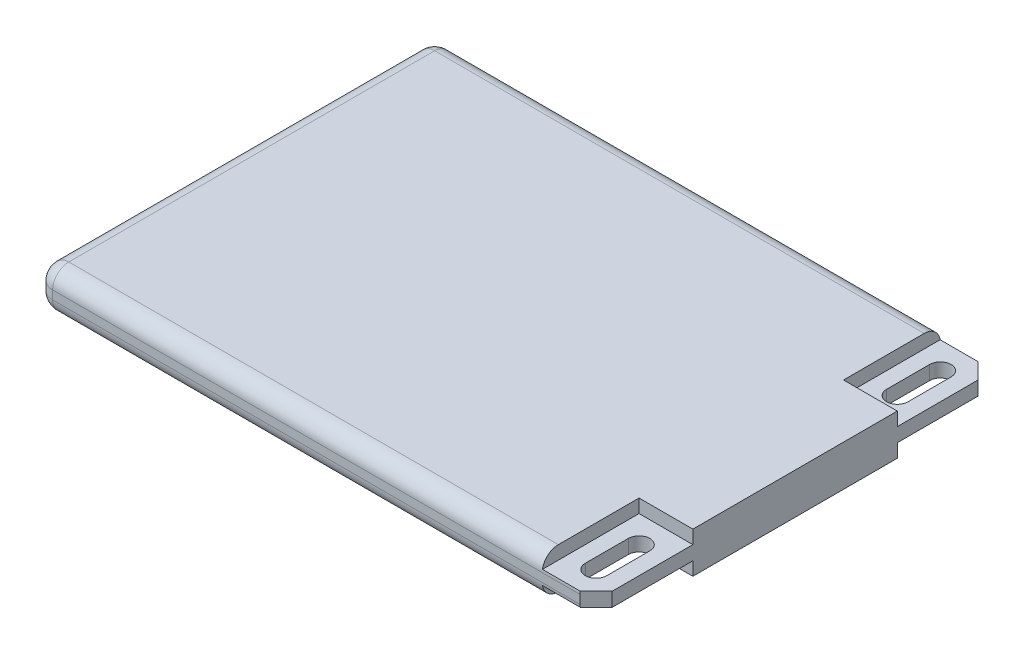
ISO-10303-21;
HEADER;
FILE_DESCRIPTION(('STEP AP214'),'2;1');
FILE_NAME('part.step','',(''),(''),'','','');
FILE_SCHEMA(('AUTOMOTIVE_DESIGN { 1 0 10303 214 1 1 1 1 }'));
ENDSEC;
DATA;
#1=APPLICATION_CONTEXT('core data for automotive mechanical design processes');
#2=APPLICATION_PROTOCOL_DEFINITION('international standard','automotive_design',2000,#1);
#3=PRODUCT_CONTEXT('',#1,'mechanical');
#4=PRODUCT('Part','Part','',(#3));
#5=PRODUCT_RELATED_PRODUCT_CATEGORY('part','',(#4));
#6=PRODUCT_DEFINITION_FORMATION('','',#4);
#7=PRODUCT_DEFINITION_CONTEXT('part definition',#1,'design');
#8=PRODUCT_DEFINITION('design','',#6,#7);
#9=PRODUCT_DEFINITION_SHAPE('','',#8);
#10=(LENGTH_UNIT() NAMED_UNIT(*) SI_UNIT(.MILLI.,.METRE.));
#11=(NAMED_UNIT(*) PLANE_ANGLE_UNIT() SI_UNIT($,.RADIAN.));
#12=(NAMED_UNIT(*) SI_UNIT($,.STERADIAN.) SOLID_ANGLE_UNIT());
#13=UNCERTAINTY_MEASURE_WITH_UNIT(LENGTH_MEASURE(1.E-05),#10,'distance_accuracy_value','');
#14=(GEOMETRIC_REPRESENTATION_CONTEXT(3) GLOBAL_UNCERTAINTY_ASSIGNED_CONTEXT((#13)) GLOBAL_UNIT_ASSIGNED_CONTEXT((#10,
#11,#12)) REPRESENTATION_CONTEXT('',''));
#15=CARTESIAN_POINT('',(0.,0.,0.));
#16=DIRECTION('',(0.,0.,1.));
#17=DIRECTION('',(1.,0.,0.));
#18=AXIS2_PLACEMENT_3D('',#15,#16,#17);
#19=CARTESIAN_POINT('',(26.,1.9,18.5));
#20=DIRECTION('',(-1.,0.,0.));
#21=DIRECTION('',(0.,0.,1.));
#22=AXIS2_PLACEMENT_3D('',#19,#20,#21);
#23=PLANE('',#22);
#24=DIRECTION('',(0.,0.,-1.));
#25=VECTOR('',#24,1.);
#26=CARTESIAN_POINT('',(26.,0.65,18.5));
#27=LINE('',#26,#25);
#28=CARTESIAN_POINT('',(26.,0.65,17.));
#29=VERTEX_POINT('',#28);
#30=CARTESIAN_POINT('',(26.,0.65,9.5));
#31=VERTEX_POINT('',#30);
#32=EDGE_CURVE('E336',#29,#31,#27,.T.);
#33=ORIENTED_EDGE('',*,*,#32,.F.);
#34=DIRECTION('',(0.,-1.,0.));
#35=VECTOR('',#34,1.);
#36=CARTESIAN_POINT('',(26.,1.9,17.));
#37=LINE('',#36,#35);
#38=CARTESIAN_POINT('',(26.,-0.65,17.));
#39=VERTEX_POINT('',#38);
#40=EDGE_CURVE('E395',#29,#39,#37,.T.);
#41=ORIENTED_EDGE('',*,*,#40,.T.);
#42=DIRECTION('',(0.,0.,-1.));
#43=VECTOR('',#42,1.);
#44=CARTESIAN_POINT('',(26.,-0.65,18.5));
#45=LINE('',#44,#43);
#46=CARTESIAN_POINT('',(26.,-0.65,9.5));
#47=VERTEX_POINT('',#46);
#48=EDGE_CURVE('E300',#39,#47,#45,.T.);
#49=ORIENTED_EDGE('',*,*,#48,.T.);
#50=DIRECTION('',(0.,-1.,0.));
#51=VECTOR('',#50,1.);
#52=CARTESIAN_POINT('',(26.,-0.65,9.5));
#53=LINE('',#52,#51);
#54=CARTESIAN_POINT('',(26.,-1.9,9.5));
#55=VERTEX_POINT('',#54);
#56=EDGE_CURVE('E313',#47,#55,#53,.T.);
#57=ORIENTED_EDGE('',*,*,#56,.T.);
#58=DIRECTION('',(0.,0.,-1.));
#59=VECTOR('',#58,1.);
#60=CARTESIAN_POINT('',(26.,-1.9,18.5));
#61=LINE('',#60,#59);
#62=CARTESIAN_POINT('',(26.,-1.9,-9.49999999999999));
#63=VERTEX_POINT('',#62);
#64=EDGE_CURVE('E368',#55,#63,#61,.T.);
#65=ORIENTED_EDGE('',*,*,#64,.T.);
#66=DIRECTION('',(0.,-1.,0.));
#67=VECTOR('',#66,1.);
#68=CARTESIAN_POINT('',(26.,-0.65,-9.5));
#69=LINE('',#68,#67);
#70=CARTESIAN_POINT('',(26.,-0.65,-9.5));
#71=VERTEX_POINT('',#70);
#72=EDGE_CURVE('E326',#71,#63,#69,.T.);
#73=ORIENTED_EDGE('',*,*,#72,.F.);
#74=DIRECTION('',(0.,0.,-1.));
#75=VECTOR('',#74,1.);
#76=CARTESIAN_POINT('',(26.,-0.65,-18.5));
#77=LINE('',#76,#75);
#78=CARTESIAN_POINT('',(26.,-0.65,-17.));
#79=VERTEX_POINT('',#78);
#80=EDGE_CURVE('E318',#71,#79,#77,.T.);
#81=ORIENTED_EDGE('',*,*,#80,.T.);
#82=DIRECTION('',(0.,1.,0.));
#83=VECTOR('',#82,1.);
#84=CARTESIAN_POINT('',(26.,1.9,-17.));
#85=LINE('',#84,#83);
#86=CARTESIAN_POINT('',(26.,0.65,-17.));
#87=VERTEX_POINT('',#86);
#88=EDGE_CURVE('E393',#79,#87,#85,.T.);
#89=ORIENTED_EDGE('',*,*,#88,.T.);
#90=DIRECTION('',(0.,0.,-1.));
#91=VECTOR('',#90,1.);
#92=CARTESIAN_POINT('',(26.,0.65,-18.5));
#93=LINE('',#92,#91);
#94=CARTESIAN_POINT('',(26.,0.65,-9.5));
#95=VERTEX_POINT('',#94);
#96=EDGE_CURVE('E352',#95,#87,#93,.T.);
#97=ORIENTED_EDGE('',*,*,#96,.F.);
#98=DIRECTION('',(0.,1.,0.));
#99=VECTOR('',#98,1.);
#100=CARTESIAN_POINT('',(26.,0.65,-9.5));
#101=LINE('',#100,#99);
#102=CARTESIAN_POINT('',(26.,1.9,-9.5));
#103=VERTEX_POINT('',#102);
#104=EDGE_CURVE('E365',#95,#103,#101,.T.);
#105=ORIENTED_EDGE('',*,*,#104,.T.);
#106=DIRECTION('',(0.,0.,-1.));
#107=VECTOR('',#106,1.);
#108=CARTESIAN_POINT('',(26.,1.9,18.5));
#109=LINE('',#108,#107);
#110=CARTESIAN_POINT('',(26.,1.9,9.5));
#111=VERTEX_POINT('',#110);
#112=EDGE_CURVE('E371',#111,#103,#109,.T.);
#113=ORIENTED_EDGE('',*,*,#112,.F.);
#114=DIRECTION('',(0.,1.,0.));
#115=VECTOR('',#114,1.);
#116=CARTESIAN_POINT('',(26.,0.65,9.5));
#117=LINE('',#116,#115);
#118=EDGE_CURVE('E344',#31,#111,#117,.T.);
#119=ORIENTED_EDGE('',*,*,#118,.F.);
#120=EDGE_LOOP('',(#33,#41,#49,#57,#65,#73,#81,#89,#97,#105,#113,#119));
#121=FACE_BOUND('',#120,.T.);
#122=ADVANCED_FACE('F32',(#121),#23,.F.);
#123=CARTESIAN_POINT('',(0.,-1.9,0.));
#124=DIRECTION('',(0.,-1.,0.));
#125=DIRECTION('',(0.,0.,-1.));
#126=AXIS2_PLACEMENT_3D('',#123,#124,#125);
#127=PLANE('',#126);
#128=DIRECTION('',(0.,0.,1.));
#129=VECTOR('',#128,1.);
#130=CARTESIAN_POINT('',(-24.5,-1.9,-18.5));
#131=LINE('',#130,#129);
#132=CARTESIAN_POINT('',(-24.5,-1.9,17.));
#133=VERTEX_POINT('',#132);
#134=CARTESIAN_POINT('',(-24.5,-1.9,-17.));
#135=VERTEX_POINT('',#134);
#136=EDGE_CURVE('E422',#133,#135,#131,.F.);
#137=ORIENTED_EDGE('',*,*,#136,.T.);
#138=DIRECTION('',(-1.,0.,0.));
#139=VECTOR('',#138,1.);
#140=CARTESIAN_POINT('',(21.,-1.9,-17.));
#141=LINE('',#140,#139);
#142=CARTESIAN_POINT('',(21.,-1.9,-17.));
#143=VERTEX_POINT('',#142);
#144=EDGE_CURVE('E424',#135,#143,#141,.F.);
#145=ORIENTED_EDGE('',*,*,#144,.T.);
#146=DIRECTION('',(0.,0.,1.));
#147=VECTOR('',#146,1.);
#148=CARTESIAN_POINT('',(21.,-1.9,-18.5));
#149=LINE('',#148,#147);
#150=CARTESIAN_POINT('',(21.,-1.9,-9.5));
#151=VERTEX_POINT('',#150);
#152=EDGE_CURVE('E322',#143,#151,#149,.T.);
#153=ORIENTED_EDGE('',*,*,#152,.T.);
#154=DIRECTION('',(1.,0.,0.));
#155=VECTOR('',#154,1.);
#156=CARTESIAN_POINT('',(26.,-1.9,-9.5));
#157=LINE('',#156,#155);
#158=EDGE_CURVE('E316',#151,#63,#157,.T.);
#159=ORIENTED_EDGE('',*,*,#158,.T.);
#160=ORIENTED_EDGE('',*,*,#64,.F.);
#161=DIRECTION('',(-1.,0.,0.));
#162=VECTOR('',#161,1.);
#163=CARTESIAN_POINT('',(26.,-1.9,9.5));
#164=LINE('',#163,#162);
#165=CARTESIAN_POINT('',(21.,-1.9,9.5));
#166=VERTEX_POINT('',#165);
#167=EDGE_CURVE('E303',#55,#166,#164,.T.);
#168=ORIENTED_EDGE('',*,*,#167,.T.);
#169=DIRECTION('',(0.,0.,1.));
#170=VECTOR('',#169,1.);
#171=CARTESIAN_POINT('',(21.,-1.9,18.5));
#172=LINE('',#171,#170);
#173=CARTESIAN_POINT('',(21.,-1.9,17.));
#174=VERTEX_POINT('',#173);
#175=EDGE_CURVE('E293',#166,#174,#172,.T.);
#176=ORIENTED_EDGE('',*,*,#175,.T.);
#177=DIRECTION('',(1.,0.,0.));
#178=VECTOR('',#177,1.);
#179=CARTESIAN_POINT('',(-26.,-1.9,17.));
#180=LINE('',#179,#178);
#181=EDGE_CURVE('E420',#174,#133,#180,.F.);
#182=ORIENTED_EDGE('',*,*,#181,.T.);
#183=EDGE_LOOP('',(#137,#145,#153,#159,#160,#168,#176,#182));
#184=FACE_BOUND('',#183,.T.);
#185=ADVANCED_FACE('F535',(#184),#127,.T.);
#186=CARTESIAN_POINT('',(-26.,1.9,18.5));
#187=DIRECTION('',(0.,0.,-1.));
#188=DIRECTION('',(-1.,0.,0.));
#189=AXIS2_PLACEMENT_3D('',#186,#187,#188);
#190=PLANE('',#189);
#191=DIRECTION('',(0.,-1.,0.));
#192=VECTOR('',#191,1.);
#193=CARTESIAN_POINT('',(-24.5,1.9,18.5));
#194=LINE('',#193,#192);
#195=CARTESIAN_POINT('',(-24.5,0.4,18.5));
#196=VERTEX_POINT('',#195);
#197=CARTESIAN_POINT('',(-24.5,-0.4,18.5));
#198=VERTEX_POINT('',#197);
#199=EDGE_CURVE('E445',#196,#198,#194,.T.);
#200=ORIENTED_EDGE('',*,*,#199,.T.);
#201=DIRECTION('',(1.,0.,0.));
#202=VECTOR('',#201,1.);
#203=CARTESIAN_POINT('',(21.,-0.4,18.5));
#204=LINE('',#203,#202);
#205=CARTESIAN_POINT('',(24.5,-0.4,18.5));
#206=VERTEX_POINT('',#205);
#207=EDGE_CURVE('E447',#198,#206,#204,.T.);
#208=ORIENTED_EDGE('',*,*,#207,.T.);
#209=DIRECTION('',(0.,1.,0.));
#210=VECTOR('',#209,1.);
#211=CARTESIAN_POINT('',(24.5,1.9,18.5));
#212=LINE('',#211,#210);
#213=CARTESIAN_POINT('',(24.5,0.4,18.5));
#214=VERTEX_POINT('',#213);
#215=EDGE_CURVE('E401',#206,#214,#212,.T.);
#216=ORIENTED_EDGE('',*,*,#215,.T.);
#217=DIRECTION('',(1.,0.,0.));
#218=VECTOR('',#217,1.);
#219=CARTESIAN_POINT('',(-26.,0.4,18.5));
#220=LINE('',#219,#218);
#221=EDGE_CURVE('E443',#214,#196,#220,.F.);
#222=ORIENTED_EDGE('',*,*,#221,.T.);
#223=EDGE_LOOP('',(#200,#208,#216,#222));
#224=FACE_BOUND('',#223,.T.);
#225=ADVANCED_FACE('F553',(#224),#190,.F.);
#226=CARTESIAN_POINT('',(-26.,1.9,-18.5));
#227=DIRECTION('',(0.,0.,1.));
#228=DIRECTION('',(1.,0.,0.));
#229=AXIS2_PLACEMENT_3D('',#226,#227,#228);
#230=PLANE('',#229);
#231=DIRECTION('',(0.,-1.,0.));
#232=VECTOR('',#231,1.);
#233=CARTESIAN_POINT('',(24.5,1.9,-18.5));
#234=LINE('',#233,#232);
#235=CARTESIAN_POINT('',(24.5,0.4,-18.5));
#236=VERTEX_POINT('',#235);
#237=CARTESIAN_POINT('',(24.5,-0.4,-18.5));
#238=VERTEX_POINT('',#237);
#239=EDGE_CURVE('E406',#236,#238,#234,.T.);
#240=ORIENTED_EDGE('',*,*,#239,.T.);
#241=DIRECTION('',(-1.,0.,0.));
#242=VECTOR('',#241,1.);
#243=CARTESIAN_POINT('',(-26.,-0.4,-18.5));
#244=LINE('',#243,#242);
#245=CARTESIAN_POINT('',(-24.5,-0.4,-18.5));
#246=VERTEX_POINT('',#245);
#247=EDGE_CURVE('E417',#238,#246,#244,.T.);
#248=ORIENTED_EDGE('',*,*,#247,.T.);
#249=DIRECTION('',(0.,-1.,0.));
#250=VECTOR('',#249,1.);
#251=CARTESIAN_POINT('',(-24.5,1.9,-18.5));
#252=LINE('',#251,#250);
#253=CARTESIAN_POINT('',(-24.5,0.4,-18.5));
#254=VERTEX_POINT('',#253);
#255=EDGE_CURVE('E415',#246,#254,#252,.F.);
#256=ORIENTED_EDGE('',*,*,#255,.T.);
#257=DIRECTION('',(-1.,0.,0.));
#258=VECTOR('',#257,1.);
#259=CARTESIAN_POINT('',(-26.,0.4,-18.5));
#260=LINE('',#259,#258);
#261=EDGE_CURVE('E413',#254,#236,#260,.F.);
#262=ORIENTED_EDGE('',*,*,#261,.T.);
#263=EDGE_LOOP('',(#240,#248,#256,#262));
#264=FACE_BOUND('',#263,.T.);
#265=ADVANCED_FACE('F642',(#264),#230,.F.);
#266=CARTESIAN_POINT('',(-26.,1.9,18.5));
#267=DIRECTION('',(1.,0.,0.));
#268=DIRECTION('',(0.,0.,-1.));
#269=AXIS2_PLACEMENT_3D('',#266,#267,#268);
#270=PLANE('',#269);
#271=DIRECTION('',(0.,-1.,0.));
#272=VECTOR('',#271,1.);
#273=CARTESIAN_POINT('',(-26.,1.9,-17.));
#274=LINE('',#273,#272);
#275=CARTESIAN_POINT('',(-26.,0.4,-17.));
#276=VERTEX_POINT('',#275);
#277=CARTESIAN_POINT('',(-26.,-0.4,-17.));
#278=VERTEX_POINT('',#277);
#279=EDGE_CURVE('E438',#276,#278,#274,.T.);
#280=ORIENTED_EDGE('',*,*,#279,.T.);
#281=DIRECTION('',(0.,0.,1.));
#282=VECTOR('',#281,1.);
#283=CARTESIAN_POINT('',(-26.,-0.4,18.5));
#284=LINE('',#283,#282);
#285=CARTESIAN_POINT('',(-26.,-0.4,17.));
#286=VERTEX_POINT('',#285);
#287=EDGE_CURVE('E441',#278,#286,#284,.T.);
#288=ORIENTED_EDGE('',*,*,#287,.T.);
#289=DIRECTION('',(0.,-1.,0.));
#290=VECTOR('',#289,1.);
#291=CARTESIAN_POINT('',(-26.,1.9,17.));
#292=LINE('',#291,#290);
#293=CARTESIAN_POINT('',(-26.,0.4,17.));
#294=VERTEX_POINT('',#293);
#295=EDGE_CURVE('E436',#286,#294,#292,.F.);
#296=ORIENTED_EDGE('',*,*,#295,.T.);
#297=DIRECTION('',(0.,0.,1.));
#298=VECTOR('',#297,1.);
#299=CARTESIAN_POINT('',(-26.,0.4,18.5));
#300=LINE('',#299,#298);
#301=EDGE_CURVE('E434',#294,#276,#300,.F.);
#302=ORIENTED_EDGE('',*,*,#301,.T.);
#303=EDGE_LOOP('',(#280,#288,#296,#302));
#304=FACE_BOUND('',#303,.T.);
#305=ADVANCED_FACE('F626',(#304),#270,.F.);
#306=CARTESIAN_POINT('',(0.,1.9,0.));
#307=DIRECTION('',(0.,-1.,0.));
#308=DIRECTION('',(0.,0.,-1.));
#309=AXIS2_PLACEMENT_3D('',#306,#307,#308);
#310=PLANE('',#309);
#311=DIRECTION('',(0.,0.,1.));
#312=VECTOR('',#311,1.);
#313=CARTESIAN_POINT('',(-24.5,1.9,0.));
#314=LINE('',#313,#312);
#315=CARTESIAN_POINT('',(-24.5,1.9,-17.));
#316=VERTEX_POINT('',#315);
#317=CARTESIAN_POINT('',(-24.5,1.9,17.));
#318=VERTEX_POINT('',#317);
#319=EDGE_CURVE('E459',#316,#318,#314,.T.);
#320=ORIENTED_EDGE('',*,*,#319,.T.);
#321=DIRECTION('',(1.,0.,0.));
#322=VECTOR('',#321,1.);
#323=CARTESIAN_POINT('',(0.,1.9,17.));
#324=LINE('',#323,#322);
#325=CARTESIAN_POINT('',(21.,1.9,17.));
#326=VERTEX_POINT('',#325);
#327=EDGE_CURVE('E461',#318,#326,#324,.T.);
#328=ORIENTED_EDGE('',*,*,#327,.T.);
#329=DIRECTION('',(0.,0.,1.));
#330=VECTOR('',#329,1.);
#331=CARTESIAN_POINT('',(21.,1.9,18.5));
#332=LINE('',#331,#330);
#333=CARTESIAN_POINT('',(21.,1.9,9.5));
#334=VERTEX_POINT('',#333);
#335=EDGE_CURVE('E339',#334,#326,#332,.T.);
#336=ORIENTED_EDGE('',*,*,#335,.F.);
#337=DIRECTION('',(-1.,0.,0.));
#338=VECTOR('',#337,1.);
#339=CARTESIAN_POINT('',(26.,1.9,9.5));
#340=LINE('',#339,#338);
#341=EDGE_CURVE('E333',#111,#334,#340,.T.);
#342=ORIENTED_EDGE('',*,*,#341,.F.);
#343=ORIENTED_EDGE('',*,*,#112,.T.);
#344=DIRECTION('',(1.,0.,0.));
#345=VECTOR('',#344,1.);
#346=CARTESIAN_POINT('',(26.,1.9,-9.5));
#347=LINE('',#346,#345);
#348=CARTESIAN_POINT('',(21.,1.9,-9.5));
#349=VERTEX_POINT('',#348);
#350=EDGE_CURVE('E356',#349,#103,#347,.T.);
#351=ORIENTED_EDGE('',*,*,#350,.F.);
#352=DIRECTION('',(0.,0.,1.));
#353=VECTOR('',#352,1.);
#354=CARTESIAN_POINT('',(21.,1.9,-18.5));
#355=LINE('',#354,#353);
#356=CARTESIAN_POINT('',(21.,1.9,-17.));
#357=VERTEX_POINT('',#356);
#358=EDGE_CURVE('E350',#357,#349,#355,.T.);
#359=ORIENTED_EDGE('',*,*,#358,.F.);
#360=DIRECTION('',(-1.,0.,0.));
#361=VECTOR('',#360,1.);
#362=CARTESIAN_POINT('',(0.,1.9,-17.));
#363=LINE('',#362,#361);
#364=EDGE_CURVE('E457',#357,#316,#363,.T.);
#365=ORIENTED_EDGE('',*,*,#364,.T.);
#366=EDGE_LOOP('',(#320,#328,#336,#342,#343,#351,#359,#365));
#367=FACE_BOUND('',#366,.T.);
#368=ADVANCED_FACE('F601',(#367),#310,.F.);
#369=CARTESIAN_POINT('',(26.,0.65,-9.5));
#370=DIRECTION('',(0.,0.,1.));
#371=DIRECTION('',(1.,0.,0.));
#372=AXIS2_PLACEMENT_3D('',#369,#370,#371);
#373=PLANE('',#372);
#374=ORIENTED_EDGE('',*,*,#350,.T.);
#375=ORIENTED_EDGE('',*,*,#104,.F.);
#376=DIRECTION('',(1.,0.,0.));
#377=VECTOR('',#376,1.);
#378=CARTESIAN_POINT('',(26.,0.65,-9.5));
#379=LINE('',#378,#377);
#380=CARTESIAN_POINT('',(21.,0.65,-9.5));
#381=VERTEX_POINT('',#380);
#382=EDGE_CURVE('E358',#381,#95,#379,.T.);
#383=ORIENTED_EDGE('',*,*,#382,.F.);
#384=DIRECTION('',(0.,1.,0.));
#385=VECTOR('',#384,1.);
#386=CARTESIAN_POINT('',(21.,0.65,-9.5));
#387=LINE('',#386,#385);
#388=EDGE_CURVE('E361',#381,#349,#387,.T.);
#389=ORIENTED_EDGE('',*,*,#388,.T.);
#390=EDGE_LOOP('',(#374,#375,#383,#389));
#391=FACE_BOUND('',#390,.T.);
#392=ADVANCED_FACE('F596',(#391),#373,.F.);
#393=CARTESIAN_POINT('',(21.,0.65,-18.5));
#394=DIRECTION('',(-1.,0.,0.));
#395=DIRECTION('',(0.,0.,1.));
#396=AXIS2_PLACEMENT_3D('',#393,#394,#395);
#397=PLANE('',#396);
#398=DIRECTION('',(0.,0.,1.));
#399=VECTOR('',#398,1.);
#400=CARTESIAN_POINT('',(21.,0.65,-18.5));
#401=LINE('',#400,#399);
#402=CARTESIAN_POINT('',(21.,0.65,-18.4790199457749));
#403=VERTEX_POINT('',#402);
#404=EDGE_CURVE('E355',#403,#381,#401,.T.);
#405=ORIENTED_EDGE('',*,*,#404,.F.);
#406=CARTESIAN_POINT('',(21.,0.4,-17.));
#407=DIRECTION('',(-1.,0.,0.));
#408=DIRECTION('',(0.,0.,1.));
#409=AXIS2_PLACEMENT_3D('',#406,#407,#408);
#410=CIRCLE('',#409,1.5);
#411=EDGE_CURVE('E11',#403,#357,#410,.F.);
#412=ORIENTED_EDGE('',*,*,#411,.T.);
#413=ORIENTED_EDGE('',*,*,#358,.T.);
#414=ORIENTED_EDGE('',*,*,#388,.F.);
#415=EDGE_LOOP('',(#405,#412,#413,#414));
#416=FACE_BOUND('',#415,.T.);
#417=ADVANCED_FACE('F904',(#416),#397,.F.);
#418=CARTESIAN_POINT('',(0.,0.65,0.));
#419=DIRECTION('',(0.,-1.,0.));
#420=DIRECTION('',(0.,0.,-1.));
#421=AXIS2_PLACEMENT_3D('',#418,#419,#420);
#422=PLANE('',#421);
#423=DIRECTION('',(0.,0.,1.));
#424=VECTOR('',#423,1.);
#425=CARTESIAN_POINT('',(22.5,0.65,-12.));
#426=LINE('',#425,#424);
#427=CARTESIAN_POINT('',(22.5,0.65,-16.));
#428=VERTEX_POINT('',#427);
#429=CARTESIAN_POINT('',(22.5,0.65,-12.));
#430=VERTEX_POINT('',#429);
#431=EDGE_CURVE('E281',#428,#430,#426,.T.);
#432=ORIENTED_EDGE('',*,*,#431,.F.);
#433=CARTESIAN_POINT('',(23.5,0.65,-16.));
#434=DIRECTION('',(0.,1.,0.));
#435=DIRECTION('',(0.,0.,-1.));
#436=AXIS2_PLACEMENT_3D('',#433,#434,#435);
#437=CIRCLE('',#436,1.);
#438=CARTESIAN_POINT('',(24.5,0.65,-16.));
#439=VERTEX_POINT('',#438);
#440=EDGE_CURVE('E277',#439,#428,#437,.T.);
#441=ORIENTED_EDGE('',*,*,#440,.F.);
#442=DIRECTION('',(0.,0.,-1.));
#443=VECTOR('',#442,1.);
#444=CARTESIAN_POINT('',(24.5,0.65,-12.));
#445=LINE('',#444,#443);
#446=CARTESIAN_POINT('',(24.5,0.65,-12.));
#447=VERTEX_POINT('',#446);
#448=EDGE_CURVE('E287',#447,#439,#445,.T.);
#449=ORIENTED_EDGE('',*,*,#448,.F.);
#450=CARTESIAN_POINT('',(23.5,0.65,-12.));
#451=DIRECTION('',(0.,1.,0.));
#452=DIRECTION('',(0.,0.,-1.));
#453=AXIS2_PLACEMENT_3D('',#450,#451,#452);
#454=CIRCLE('',#453,1.);
#455=EDGE_CURVE('E284',#430,#447,#454,.T.);
#456=ORIENTED_EDGE('',*,*,#455,.F.);
#457=EDGE_LOOP('',(#432,#441,#449,#456));
#458=FACE_BOUND('',#457,.T.);
#459=DIRECTION('',(0.707106781186546,0.,0.707106781186549));
#460=VECTOR('',#459,1.);
#461=CARTESIAN_POINT('',(24.5,0.65,-18.5));
#462=LINE('',#461,#460);
#463=CARTESIAN_POINT('',(24.5209800542251,0.65,-18.4790199457749));
#464=VERTEX_POINT('',#463);
#465=EDGE_CURVE('E411',#87,#464,#462,.F.);
#466=ORIENTED_EDGE('',*,*,#465,.T.);
#467=DIRECTION('',(-1.,0.,0.));
#468=VECTOR('',#467,1.);
#469=CARTESIAN_POINT('',(24.5209800542251,0.65,-18.4790199457749));
#470=LINE('',#469,#468);
#471=EDGE_CURVE('E41',#464,#403,#470,.T.);
#472=ORIENTED_EDGE('',*,*,#471,.T.);
#473=ORIENTED_EDGE('',*,*,#404,.T.);
#474=ORIENTED_EDGE('',*,*,#382,.T.);
#475=ORIENTED_EDGE('',*,*,#96,.T.);
#476=EDGE_LOOP('',(#466,#472,#473,#474,#475));
#477=FACE_BOUND('',#476,.T.);
#478=ADVANCED_FACE('F592',(#458,#477),#422,.F.);
#479=CARTESIAN_POINT('',(21.,0.65,18.5));
#480=DIRECTION('',(-1.,0.,0.));
#481=DIRECTION('',(0.,0.,1.));
#482=AXIS2_PLACEMENT_3D('',#479,#480,#481);
#483=PLANE('',#482);
#484=ORIENTED_EDGE('',*,*,#335,.T.);
#485=CARTESIAN_POINT('',(21.,0.4,17.));
#486=DIRECTION('',(-1.,0.,0.));
#487=DIRECTION('',(0.,0.,1.));
#488=AXIS2_PLACEMENT_3D('',#485,#486,#487);
#489=CIRCLE('',#488,1.5);
#490=CARTESIAN_POINT('',(21.,0.65,18.4790199457749));
#491=VERTEX_POINT('',#490);
#492=EDGE_CURVE('E56',#326,#491,#489,.F.);
#493=ORIENTED_EDGE('',*,*,#492,.T.);
#494=DIRECTION('',(0.,0.,1.));
#495=VECTOR('',#494,1.);
#496=CARTESIAN_POINT('',(21.,0.65,18.5));
#497=LINE('',#496,#495);
#498=CARTESIAN_POINT('',(21.,0.65,9.5));
#499=VERTEX_POINT('',#498);
#500=EDGE_CURVE('E342',#499,#491,#497,.T.);
#501=ORIENTED_EDGE('',*,*,#500,.F.);
#502=DIRECTION('',(0.,1.,0.));
#503=VECTOR('',#502,1.);
#504=CARTESIAN_POINT('',(21.,0.65,9.5));
#505=LINE('',#504,#503);
#506=EDGE_CURVE('E348',#499,#334,#505,.T.);
#507=ORIENTED_EDGE('',*,*,#506,.T.);
#508=EDGE_LOOP('',(#484,#493,#501,#507));
#509=FACE_BOUND('',#508,.T.);
#510=ADVANCED_FACE('F607',(#509),#483,.F.);
#511=CARTESIAN_POINT('',(26.,0.65,9.5));
#512=DIRECTION('',(0.,0.,-1.));
#513=DIRECTION('',(-1.,0.,0.));
#514=AXIS2_PLACEMENT_3D('',#511,#512,#513);
#515=PLANE('',#514);
#516=ORIENTED_EDGE('',*,*,#341,.T.);
#517=ORIENTED_EDGE('',*,*,#506,.F.);
#518=DIRECTION('',(-1.,0.,0.));
#519=VECTOR('',#518,1.);
#520=CARTESIAN_POINT('',(26.,0.65,9.5));
#521=LINE('',#520,#519);
#522=EDGE_CURVE('E338',#31,#499,#521,.T.);
#523=ORIENTED_EDGE('',*,*,#522,.F.);
#524=ORIENTED_EDGE('',*,*,#118,.T.);
#525=EDGE_LOOP('',(#516,#517,#523,#524));
#526=FACE_BOUND('',#525,.T.);
#527=ADVANCED_FACE('F605',(#526),#515,.F.);
#528=CARTESIAN_POINT('',(0.,0.65,0.));
#529=DIRECTION('',(0.,1.,0.));
#530=DIRECTION('',(0.,0.,1.));
#531=AXIS2_PLACEMENT_3D('',#528,#529,#530);
#532=PLANE('',#531);
#533=CARTESIAN_POINT('',(23.5,0.65,12.));
#534=DIRECTION('',(0.,1.,0.));
#535=DIRECTION('',(0.,0.,1.));
#536=AXIS2_PLACEMENT_3D('',#533,#534,#535);
#537=CIRCLE('',#536,1.);
#538=CARTESIAN_POINT('',(24.5,0.65,12.));
#539=VERTEX_POINT('',#538);
#540=CARTESIAN_POINT('',(22.5,0.65,12.));
#541=VERTEX_POINT('',#540);
#542=EDGE_CURVE('E265',#539,#541,#537,.T.);
#543=ORIENTED_EDGE('',*,*,#542,.F.);
#544=DIRECTION('',(0.,0.,-1.));
#545=VECTOR('',#544,1.);
#546=CARTESIAN_POINT('',(24.5,0.65,12.));
#547=LINE('',#546,#545);
#548=CARTESIAN_POINT('',(24.5,0.65,16.));
#549=VERTEX_POINT('',#548);
#550=EDGE_CURVE('E270',#549,#539,#547,.T.);
#551=ORIENTED_EDGE('',*,*,#550,.F.);
#552=CARTESIAN_POINT('',(23.5,0.65,16.));
#553=DIRECTION('',(0.,1.,0.));
#554=DIRECTION('',(0.,0.,1.));
#555=AXIS2_PLACEMENT_3D('',#552,#553,#554);
#556=CIRCLE('',#555,1.);
#557=CARTESIAN_POINT('',(22.5,0.65,16.));
#558=VERTEX_POINT('',#557);
#559=EDGE_CURVE('E249',#558,#549,#556,.T.);
#560=ORIENTED_EDGE('',*,*,#559,.F.);
#561=DIRECTION('',(0.,0.,1.));
#562=VECTOR('',#561,1.);
#563=CARTESIAN_POINT('',(22.5,0.65,12.));
#564=LINE('',#563,#562);
#565=EDGE_CURVE('E260',#541,#558,#564,.T.);
#566=ORIENTED_EDGE('',*,*,#565,.F.);
#567=EDGE_LOOP('',(#543,#551,#560,#566));
#568=FACE_BOUND('',#567,.T.);
#569=ORIENTED_EDGE('',*,*,#500,.T.);
#570=DIRECTION('',(1.,0.,0.));
#571=VECTOR('',#570,1.);
#572=CARTESIAN_POINT('',(21.,0.65,18.4790199457749));
#573=LINE('',#572,#571);
#574=CARTESIAN_POINT('',(24.5209800542251,0.65,18.4790199457749));
#575=VERTEX_POINT('',#574);
#576=EDGE_CURVE('E464',#491,#575,#573,.T.);
#577=ORIENTED_EDGE('',*,*,#576,.T.);
#578=DIRECTION('',(-0.707106781186549,0.,0.707106781186546));
#579=VECTOR('',#578,1.);
#580=CARTESIAN_POINT('',(21.4999999999999,0.65,21.5));
#581=LINE('',#580,#579);
#582=EDGE_CURVE('E404',#575,#29,#581,.F.);
#583=ORIENTED_EDGE('',*,*,#582,.T.);
#584=ORIENTED_EDGE('',*,*,#32,.T.);
#585=ORIENTED_EDGE('',*,*,#522,.T.);
#586=EDGE_LOOP('',(#569,#577,#583,#584,#585));
#587=FACE_BOUND('',#586,.T.);
#588=ADVANCED_FACE('F267',(#568,#587),#532,.T.);
#589=CARTESIAN_POINT('',(21.,-0.65,-18.5));
#590=DIRECTION('',(1.,0.,0.));
#591=DIRECTION('',(0.,0.,-1.));
#592=AXIS2_PLACEMENT_3D('',#589,#590,#591);
#593=PLANE('',#592);
#594=ORIENTED_EDGE('',*,*,#152,.F.);
#595=CARTESIAN_POINT('',(21.,-0.4,-17.));
#596=DIRECTION('',(1.,0.,0.));
#597=DIRECTION('',(0.,0.,-1.));
#598=AXIS2_PLACEMENT_3D('',#595,#596,#597);
#599=CIRCLE('',#598,1.5);
#600=CARTESIAN_POINT('',(21.,-0.65,-18.4790199457749));
#601=VERTEX_POINT('',#600);
#602=EDGE_CURVE('E426',#143,#601,#599,.T.);
#603=ORIENTED_EDGE('',*,*,#602,.T.);
#604=DIRECTION('',(0.,0.,1.));
#605=VECTOR('',#604,1.);
#606=CARTESIAN_POINT('',(21.,-0.65,-18.5));
#607=LINE('',#606,#605);
#608=CARTESIAN_POINT('',(21.,-0.65,-9.5));
#609=VERTEX_POINT('',#608);
#610=EDGE_CURVE('E324',#601,#609,#607,.T.);
#611=ORIENTED_EDGE('',*,*,#610,.T.);
#612=DIRECTION('',(0.,-1.,0.));
#613=VECTOR('',#612,1.);
#614=CARTESIAN_POINT('',(21.,-0.65,-9.5));
#615=LINE('',#614,#613);
#616=EDGE_CURVE('E330',#609,#151,#615,.T.);
#617=ORIENTED_EDGE('',*,*,#616,.T.);
#618=EDGE_LOOP('',(#594,#603,#611,#617));
#619=FACE_BOUND('',#618,.T.);
#620=ADVANCED_FACE('F573',(#619),#593,.T.);
#621=CARTESIAN_POINT('',(26.,-0.65,-9.5));
#622=DIRECTION('',(0.,0.,-1.));
#623=DIRECTION('',(-1.,0.,0.));
#624=AXIS2_PLACEMENT_3D('',#621,#622,#623);
#625=PLANE('',#624);
#626=ORIENTED_EDGE('',*,*,#158,.F.);
#627=ORIENTED_EDGE('',*,*,#616,.F.);
#628=DIRECTION('',(1.,0.,0.));
#629=VECTOR('',#628,1.);
#630=CARTESIAN_POINT('',(26.,-0.65,-9.5));
#631=LINE('',#630,#629);
#632=EDGE_CURVE('E321',#609,#71,#631,.T.);
#633=ORIENTED_EDGE('',*,*,#632,.T.);
#634=ORIENTED_EDGE('',*,*,#72,.T.);
#635=EDGE_LOOP('',(#626,#627,#633,#634));
#636=FACE_BOUND('',#635,.T.);
#637=ADVANCED_FACE('F835',(#636),#625,.T.);
#638=CARTESIAN_POINT('',(0.,-0.65,0.));
#639=DIRECTION('',(0.,1.,0.));
#640=DIRECTION('',(0.,0.,-1.));
#641=AXIS2_PLACEMENT_3D('',#638,#639,#640);
#642=PLANE('',#641);
#643=DIRECTION('',(0.,0.,-1.));
#644=VECTOR('',#643,1.);
#645=CARTESIAN_POINT('',(24.5,-0.65,0.));
#646=LINE('',#645,#644);
#647=CARTESIAN_POINT('',(24.5,-0.65,-12.));
#648=VERTEX_POINT('',#647);
#649=CARTESIAN_POINT('',(24.5,-0.65,-16.));
#650=VERTEX_POINT('',#649);
#651=EDGE_CURVE('E380',#648,#650,#646,.T.);
#652=ORIENTED_EDGE('',*,*,#651,.T.);
#653=CARTESIAN_POINT('',(23.5,-0.65,-16.));
#654=DIRECTION('',(0.,1.,0.));
#655=DIRECTION('',(0.,0.,1.));
#656=AXIS2_PLACEMENT_3D('',#653,#654,#655);
#657=CIRCLE('',#656,1.);
#658=CARTESIAN_POINT('',(22.5,-0.65,-16.));
#659=VERTEX_POINT('',#658);
#660=EDGE_CURVE('E383',#650,#659,#657,.T.);
#661=ORIENTED_EDGE('',*,*,#660,.T.);
#662=DIRECTION('',(0.,0.,1.));
#663=VECTOR('',#662,1.);
#664=CARTESIAN_POINT('',(22.5,-0.65,0.));
#665=LINE('',#664,#663);
#666=CARTESIAN_POINT('',(22.5,-0.65,-12.));
#667=VERTEX_POINT('',#666);
#668=EDGE_CURVE('E373',#659,#667,#665,.T.);
#669=ORIENTED_EDGE('',*,*,#668,.T.);
#670=CARTESIAN_POINT('',(23.5,-0.65,-12.));
#671=DIRECTION('',(0.,1.,0.));
#672=DIRECTION('',(0.,0.,1.));
#673=AXIS2_PLACEMENT_3D('',#670,#671,#672);
#674=CIRCLE('',#673,1.);
#675=EDGE_CURVE('E377',#667,#648,#674,.T.);
#676=ORIENTED_EDGE('',*,*,#675,.T.);
#677=EDGE_LOOP('',(#652,#661,#669,#676));
#678=FACE_BOUND('',#677,.T.);
#679=ORIENTED_EDGE('',*,*,#610,.F.);
#680=DIRECTION('',(1.,0.,0.));
#681=VECTOR('',#680,1.);
#682=CARTESIAN_POINT('',(21.,-0.65,-18.4790199457749));
#683=LINE('',#682,#681);
#684=CARTESIAN_POINT('',(24.5209800542251,-0.65,-18.4790199457749));
#685=VERTEX_POINT('',#684);
#686=EDGE_CURVE('E428',#601,#685,#683,.T.);
#687=ORIENTED_EDGE('',*,*,#686,.T.);
#688=DIRECTION('',(-0.707106781186546,0.,-0.707106781186549));
#689=VECTOR('',#688,1.);
#690=CARTESIAN_POINT('',(24.5,-0.65,-18.5));
#691=LINE('',#690,#689);
#692=EDGE_CURVE('E409',#685,#79,#691,.F.);
#693=ORIENTED_EDGE('',*,*,#692,.T.);
#694=ORIENTED_EDGE('',*,*,#80,.F.);
#695=ORIENTED_EDGE('',*,*,#632,.F.);
#696=EDGE_LOOP('',(#679,#687,#693,#694,#695));
#697=FACE_BOUND('',#696,.T.);
#698=ADVANCED_FACE('F583',(#678,#697),#642,.F.);
#699=CARTESIAN_POINT('',(26.,-0.65,9.5));
#700=DIRECTION('',(0.,0.,1.));
#701=DIRECTION('',(1.,0.,0.));
#702=AXIS2_PLACEMENT_3D('',#699,#700,#701);
#703=PLANE('',#702);
#704=ORIENTED_EDGE('',*,*,#167,.F.);
#705=ORIENTED_EDGE('',*,*,#56,.F.);
#706=DIRECTION('',(-1.,0.,0.));
#707=VECTOR('',#706,1.);
#708=CARTESIAN_POINT('',(26.,-0.65,9.5));
#709=LINE('',#708,#707);
#710=CARTESIAN_POINT('',(21.,-0.65,9.5));
#711=VERTEX_POINT('',#710);
#712=EDGE_CURVE('E306',#47,#711,#709,.T.);
#713=ORIENTED_EDGE('',*,*,#712,.T.);
#714=DIRECTION('',(0.,-1.,0.));
#715=VECTOR('',#714,1.);
#716=CARTESIAN_POINT('',(21.,-0.65,9.5));
#717=LINE('',#716,#715);
#718=EDGE_CURVE('E308',#711,#166,#717,.T.);
#719=ORIENTED_EDGE('',*,*,#718,.T.);
#720=EDGE_LOOP('',(#704,#705,#713,#719));
#721=FACE_BOUND('',#720,.T.);
#722=ADVANCED_FACE('F539',(#721),#703,.T.);
#723=CARTESIAN_POINT('',(21.,-0.65,18.5));
#724=DIRECTION('',(1.,0.,0.));
#725=DIRECTION('',(0.,0.,-1.));
#726=AXIS2_PLACEMENT_3D('',#723,#724,#725);
#727=PLANE('',#726);
#728=DIRECTION('',(0.,0.,1.));
#729=VECTOR('',#728,1.);
#730=CARTESIAN_POINT('',(21.,-0.65,18.5));
#731=LINE('',#730,#729);
#732=CARTESIAN_POINT('',(21.,-0.65,18.4790199457749));
#733=VERTEX_POINT('',#732);
#734=EDGE_CURVE('E302',#711,#733,#731,.T.);
#735=ORIENTED_EDGE('',*,*,#734,.T.);
#736=CARTESIAN_POINT('',(21.,-0.4,17.));
#737=DIRECTION('',(1.,0.,0.));
#738=DIRECTION('',(0.,0.,-1.));
#739=AXIS2_PLACEMENT_3D('',#736,#737,#738);
#740=CIRCLE('',#739,1.5);
#741=EDGE_CURVE('E455',#733,#174,#740,.T.);
#742=ORIENTED_EDGE('',*,*,#741,.T.);
#743=ORIENTED_EDGE('',*,*,#175,.F.);
#744=ORIENTED_EDGE('',*,*,#718,.F.);
#745=EDGE_LOOP('',(#735,#742,#743,#744));
#746=FACE_BOUND('',#745,.T.);
#747=ADVANCED_FACE('F516',(#746),#727,.T.);
#748=CARTESIAN_POINT('',(0.,-0.65,0.));
#749=DIRECTION('',(0.,-1.,0.));
#750=DIRECTION('',(0.,0.,1.));
#751=AXIS2_PLACEMENT_3D('',#748,#749,#750);
#752=PLANE('',#751);
#753=CARTESIAN_POINT('',(23.5,-0.65,12.));
#754=DIRECTION('',(0.,-1.,0.));
#755=DIRECTION('',(0.,0.,-1.));
#756=AXIS2_PLACEMENT_3D('',#753,#754,#755);
#757=CIRCLE('',#756,1.);
#758=CARTESIAN_POINT('',(22.5,-0.65,12.));
#759=VERTEX_POINT('',#758);
#760=CARTESIAN_POINT('',(24.5,-0.65,12.));
#761=VERTEX_POINT('',#760);
#762=EDGE_CURVE('E391',#759,#761,#757,.T.);
#763=ORIENTED_EDGE('',*,*,#762,.F.);
#764=DIRECTION('',(0.,0.,-1.));
#765=VECTOR('',#764,1.);
#766=CARTESIAN_POINT('',(22.5,-0.65,0.));
#767=LINE('',#766,#765);
#768=CARTESIAN_POINT('',(22.5,-0.65,16.));
#769=VERTEX_POINT('',#768);
#770=EDGE_CURVE('E386',#769,#759,#767,.T.);
#771=ORIENTED_EDGE('',*,*,#770,.F.);
#772=CARTESIAN_POINT('',(23.5,-0.65,16.));
#773=DIRECTION('',(0.,-1.,0.));
#774=DIRECTION('',(0.,0.,-1.));
#775=AXIS2_PLACEMENT_3D('',#772,#773,#774);
#776=CIRCLE('',#775,1.);
#777=CARTESIAN_POINT('',(24.5,-0.65,16.));
#778=VERTEX_POINT('',#777);
#779=EDGE_CURVE('E252',#778,#769,#776,.T.);
#780=ORIENTED_EDGE('',*,*,#779,.F.);
#781=DIRECTION('',(0.,0.,1.));
#782=VECTOR('',#781,1.);
#783=CARTESIAN_POINT('',(24.5,-0.65,0.));
#784=LINE('',#783,#782);
#785=EDGE_CURVE('E389',#761,#778,#784,.T.);
#786=ORIENTED_EDGE('',*,*,#785,.F.);
#787=EDGE_LOOP('',(#763,#771,#780,#786));
#788=FACE_BOUND('',#787,.T.);
#789=DIRECTION('',(0.707106781186549,0.,-0.707106781186546));
#790=VECTOR('',#789,1.);
#791=CARTESIAN_POINT('',(21.4999999999999,-0.65,21.5));
#792=LINE('',#791,#790);
#793=CARTESIAN_POINT('',(24.5209800542251,-0.65,18.4790199457749));
#794=VERTEX_POINT('',#793);
#795=EDGE_CURVE('E398',#39,#794,#792,.F.);
#796=ORIENTED_EDGE('',*,*,#795,.T.);
#797=DIRECTION('',(-1.,0.,0.));
#798=VECTOR('',#797,1.);
#799=CARTESIAN_POINT('',(24.5209800542251,-0.65,18.4790199457749));
#800=LINE('',#799,#798);
#801=EDGE_CURVE('E453',#794,#733,#800,.T.);
#802=ORIENTED_EDGE('',*,*,#801,.T.);
#803=ORIENTED_EDGE('',*,*,#734,.F.);
#804=ORIENTED_EDGE('',*,*,#712,.F.);
#805=ORIENTED_EDGE('',*,*,#48,.F.);
#806=EDGE_LOOP('',(#796,#802,#803,#804,#805));
#807=FACE_BOUND('',#806,.T.);
#808=ADVANCED_FACE('F512',(#788,#807),#752,.T.);
#809=CARTESIAN_POINT('',(23.5,-1.9,-16.));
#810=DIRECTION('',(0.,1.,0.));
#811=DIRECTION('',(0.,0.,1.));
#812=AXIS2_PLACEMENT_3D('',#809,#810,#811);
#813=CYLINDRICAL_SURFACE('',#812,1.);
#814=DIRECTION('',(0.,1.,0.));
#815=VECTOR('',#814,1.);
#816=CARTESIAN_POINT('',(24.5,-1.9,-16.));
#817=LINE('',#816,#815);
#818=EDGE_CURVE('E291',#650,#439,#817,.T.);
#819=ORIENTED_EDGE('',*,*,#818,.T.);
#820=ORIENTED_EDGE('',*,*,#440,.T.);
#821=DIRECTION('',(0.,1.,0.));
#822=VECTOR('',#821,1.);
#823=CARTESIAN_POINT('',(22.5,-1.9,-16.));
#824=LINE('',#823,#822);
#825=EDGE_CURVE('E290',#659,#428,#824,.T.);
#826=ORIENTED_EDGE('',*,*,#825,.F.);
#827=ORIENTED_EDGE('',*,*,#660,.F.);
#828=EDGE_LOOP('',(#819,#820,#826,#827));
#829=FACE_BOUND('',#828,.T.);
#830=ADVANCED_FACE('F515',(#829),#813,.F.);
#831=CARTESIAN_POINT('',(24.5,-1.9,-12.));
#832=DIRECTION('',(1.,0.,0.));
#833=DIRECTION('',(0.,0.,-1.));
#834=AXIS2_PLACEMENT_3D('',#831,#832,#833);
#835=PLANE('',#834);
#836=DIRECTION('',(0.,1.,0.));
#837=VECTOR('',#836,1.);
#838=CARTESIAN_POINT('',(24.5,-1.9,-12.));
#839=LINE('',#838,#837);
#840=EDGE_CURVE('E294',#648,#447,#839,.T.);
#841=ORIENTED_EDGE('',*,*,#840,.T.);
#842=ORIENTED_EDGE('',*,*,#448,.T.);
#843=ORIENTED_EDGE('',*,*,#818,.F.);
#844=ORIENTED_EDGE('',*,*,#651,.F.);
#845=EDGE_LOOP('',(#841,#842,#843,#844));
#846=FACE_BOUND('',#845,.T.);
#847=ADVANCED_FACE('F791',(#846),#835,.F.);
#848=CARTESIAN_POINT('',(23.5,-1.9,-12.));
#849=DIRECTION('',(0.,1.,0.));
#850=DIRECTION('',(0.,0.,1.));
#851=AXIS2_PLACEMENT_3D('',#848,#849,#850);
#852=CYLINDRICAL_SURFACE('',#851,1.);
#853=DIRECTION('',(0.,1.,0.));
#854=VECTOR('',#853,1.);
#855=CARTESIAN_POINT('',(22.5,-1.9,-12.));
#856=LINE('',#855,#854);
#857=EDGE_CURVE('E296',#667,#430,#856,.T.);
#858=ORIENTED_EDGE('',*,*,#857,.T.);
#859=ORIENTED_EDGE('',*,*,#455,.T.);
#860=ORIENTED_EDGE('',*,*,#840,.F.);
#861=ORIENTED_EDGE('',*,*,#675,.F.);
#862=EDGE_LOOP('',(#858,#859,#860,#861));
#863=FACE_BOUND('',#862,.T.);
#864=ADVANCED_FACE('F782',(#863),#852,.F.);
#865=CARTESIAN_POINT('',(22.5,-1.9,-12.));
#866=DIRECTION('',(-1.,0.,0.));
#867=DIRECTION('',(0.,0.,1.));
#868=AXIS2_PLACEMENT_3D('',#865,#866,#867);
#869=PLANE('',#868);
#870=ORIENTED_EDGE('',*,*,#825,.T.);
#871=ORIENTED_EDGE('',*,*,#431,.T.);
#872=ORIENTED_EDGE('',*,*,#857,.F.);
#873=ORIENTED_EDGE('',*,*,#668,.F.);
#874=EDGE_LOOP('',(#870,#871,#872,#873));
#875=FACE_BOUND('',#874,.T.);
#876=ADVANCED_FACE('F774',(#875),#869,.F.);
#877=CARTESIAN_POINT('',(23.5,-1.9,12.));
#878=DIRECTION('',(0.,1.,0.));
#879=DIRECTION('',(0.,0.,1.));
#880=AXIS2_PLACEMENT_3D('',#877,#878,#879);
#881=CYLINDRICAL_SURFACE('',#880,1.);
#882=ORIENTED_EDGE('',*,*,#762,.T.);
#883=DIRECTION('',(0.,1.,0.));
#884=VECTOR('',#883,1.);
#885=CARTESIAN_POINT('',(24.5,-1.9,12.));
#886=LINE('',#885,#884);
#887=EDGE_CURVE('E275',#761,#539,#886,.T.);
#888=ORIENTED_EDGE('',*,*,#887,.T.);
#889=ORIENTED_EDGE('',*,*,#542,.T.);
#890=DIRECTION('',(0.,1.,0.));
#891=VECTOR('',#890,1.);
#892=CARTESIAN_POINT('',(22.5,-1.9,12.));
#893=LINE('',#892,#891);
#894=EDGE_CURVE('E256',#759,#541,#893,.T.);
#895=ORIENTED_EDGE('',*,*,#894,.F.);
#896=EDGE_LOOP('',(#882,#888,#889,#895));
#897=FACE_BOUND('',#896,.T.);
#898=ADVANCED_FACE('F505',(#897),#881,.F.);
#899=CARTESIAN_POINT('',(24.5,-1.9,12.));
#900=DIRECTION('',(1.,0.,0.));
#901=DIRECTION('',(0.,0.,-1.));
#902=AXIS2_PLACEMENT_3D('',#899,#900,#901);
#903=PLANE('',#902);
#904=ORIENTED_EDGE('',*,*,#785,.T.);
#905=DIRECTION('',(0.,1.,0.));
#906=VECTOR('',#905,1.);
#907=CARTESIAN_POINT('',(24.5,-1.9,16.));
#908=LINE('',#907,#906);
#909=EDGE_CURVE('E255',#778,#549,#908,.T.);
#910=ORIENTED_EDGE('',*,*,#909,.T.);
#911=ORIENTED_EDGE('',*,*,#550,.T.);
#912=ORIENTED_EDGE('',*,*,#887,.F.);
#913=EDGE_LOOP('',(#904,#910,#911,#912));
#914=FACE_BOUND('',#913,.T.);
#915=ADVANCED_FACE('F510',(#914),#903,.F.);
#916=CARTESIAN_POINT('',(23.5,-1.9,16.));
#917=DIRECTION('',(0.,1.,0.));
#918=DIRECTION('',(0.,0.,1.));
#919=AXIS2_PLACEMENT_3D('',#916,#917,#918);
#920=CYLINDRICAL_SURFACE('',#919,1.);
#921=ORIENTED_EDGE('',*,*,#779,.T.);
#922=DIRECTION('',(0.,1.,0.));
#923=VECTOR('',#922,1.);
#924=CARTESIAN_POINT('',(22.5,-1.9,16.));
#925=LINE('',#924,#923);
#926=EDGE_CURVE('E244',#769,#558,#925,.T.);
#927=ORIENTED_EDGE('',*,*,#926,.T.);
#928=ORIENTED_EDGE('',*,*,#559,.T.);
#929=ORIENTED_EDGE('',*,*,#909,.F.);
#930=EDGE_LOOP('',(#921,#927,#928,#929));
#931=FACE_BOUND('',#930,.T.);
#932=ADVANCED_FACE('F246',(#931),#920,.F.);
#933=CARTESIAN_POINT('',(22.5,-1.9,12.));
#934=DIRECTION('',(-1.,0.,0.));
#935=DIRECTION('',(0.,0.,1.));
#936=AXIS2_PLACEMENT_3D('',#933,#934,#935);
#937=PLANE('',#936);
#938=ORIENTED_EDGE('',*,*,#770,.T.);
#939=ORIENTED_EDGE('',*,*,#894,.T.);
#940=ORIENTED_EDGE('',*,*,#565,.T.);
#941=ORIENTED_EDGE('',*,*,#926,.F.);
#942=EDGE_LOOP('',(#938,#939,#940,#941));
#943=FACE_BOUND('',#942,.T.);
#944=ADVANCED_FACE('F261',(#943),#937,.F.);
#945=CARTESIAN_POINT('',(26.,1.9,17.));
#946=DIRECTION('',(-0.707106781186546,0.,-0.707106781186549));
#947=DIRECTION('',(0.,-1.,0.));
#948=AXIS2_PLACEMENT_3D('',#945,#946,#947);
#949=PLANE('',#948);
#950=ORIENTED_EDGE('',*,*,#215,.F.);
#951=CARTESIAN_POINT('',(26.,-0.4,17.));
#952=DIRECTION('',(-0.707106781186546,0.,-0.707106781186549));
#953=DIRECTION('',(-0.707106781186549,0.,0.707106781186546));
#954=AXIS2_PLACEMENT_3D('',#951,#952,#953);
#955=ELLIPSE('',#954,2.12132034355965,1.5);
#956=EDGE_CURVE('E451',#206,#794,#955,.F.);
#957=ORIENTED_EDGE('',*,*,#956,.T.);
#958=ORIENTED_EDGE('',*,*,#795,.F.);
#959=ORIENTED_EDGE('',*,*,#40,.F.);
#960=ORIENTED_EDGE('',*,*,#582,.F.);
#961=CARTESIAN_POINT('',(26.,0.4,17.));
#962=DIRECTION('',(-0.707106781186546,0.,-0.707106781186549));
#963=DIRECTION('',(0.707106781186549,0.,-0.707106781186546));
#964=AXIS2_PLACEMENT_3D('',#961,#962,#963);
#965=ELLIPSE('',#964,2.12132034355965,1.5);
#966=EDGE_CURVE('E449',#575,#214,#965,.F.);
#967=ORIENTED_EDGE('',*,*,#966,.T.);
#968=EDGE_LOOP('',(#950,#957,#958,#959,#960,#967));
#969=FACE_BOUND('',#968,.T.);
#970=ADVANCED_FACE('F546',(#969),#949,.F.);
#971=CARTESIAN_POINT('',(24.5,1.9,-18.5));
#972=DIRECTION('',(-0.707106781186549,0.,0.707106781186546));
#973=DIRECTION('',(0.,-1.,0.));
#974=AXIS2_PLACEMENT_3D('',#971,#972,#973);
#975=PLANE('',#974);
#976=ORIENTED_EDGE('',*,*,#692,.F.);
#977=CARTESIAN_POINT('',(26.,-0.4,-17.));
#978=DIRECTION('',(-0.707106781186549,0.,0.707106781186546));
#979=DIRECTION('',(0.707106781186546,0.,0.707106781186549));
#980=AXIS2_PLACEMENT_3D('',#977,#978,#979);
#981=ELLIPSE('',#980,2.12132034355964,1.5);
#982=EDGE_CURVE('E432',#685,#238,#981,.F.);
#983=ORIENTED_EDGE('',*,*,#982,.T.);
#984=ORIENTED_EDGE('',*,*,#239,.F.);
#985=CARTESIAN_POINT('',(26.,0.4,-17.));
#986=DIRECTION('',(-0.707106781186549,0.,0.707106781186546));
#987=DIRECTION('',(-0.707106781186546,0.,-0.707106781186549));
#988=AXIS2_PLACEMENT_3D('',#985,#986,#987);
#989=ELLIPSE('',#988,2.12132034355964,1.5);
#990=EDGE_CURVE('E430',#236,#464,#989,.F.);
#991=ORIENTED_EDGE('',*,*,#990,.T.);
#992=ORIENTED_EDGE('',*,*,#465,.F.);
#993=ORIENTED_EDGE('',*,*,#88,.F.);
#994=EDGE_LOOP('',(#976,#983,#984,#991,#992,#993));
#995=FACE_BOUND('',#994,.T.);
#996=ADVANCED_FACE('F588',(#995),#975,.F.);
#997=CARTESIAN_POINT('',(0.,0.4,17.));
#998=DIRECTION('',(1.,0.,0.));
#999=DIRECTION('',(0.,0.,-1.));
#1000=AXIS2_PLACEMENT_3D('',#997,#998,#999);
#1001=CYLINDRICAL_SURFACE('',#1000,1.5);
#1002=CARTESIAN_POINT('',(-24.5,0.4,17.));
#1003=DIRECTION('',(-1.,0.,0.));
#1004=DIRECTION('',(0.,0.,1.));
#1005=AXIS2_PLACEMENT_3D('',#1002,#1003,#1004);
#1006=CIRCLE('',#1005,1.5);
#1007=EDGE_CURVE('E36',#196,#318,#1006,.T.);
#1008=ORIENTED_EDGE('',*,*,#1007,.F.);
#1009=ORIENTED_EDGE('',*,*,#221,.F.);
#1010=ORIENTED_EDGE('',*,*,#966,.F.);
#1011=ORIENTED_EDGE('',*,*,#576,.F.);
#1012=ORIENTED_EDGE('',*,*,#492,.F.);
#1013=ORIENTED_EDGE('',*,*,#327,.F.);
#1014=EDGE_LOOP('',(#1008,#1009,#1010,#1011,#1012,#1013));
#1015=FACE_BOUND('',#1014,.T.);
#1016=ADVANCED_FACE('F34',(#1015),#1001,.T.);
#1017=CARTESIAN_POINT('',(-24.5,0.4,17.));
#1018=DIRECTION('',(0.,0.,1.));
#1019=DIRECTION('',(1.,0.,0.));
#1020=AXIS2_PLACEMENT_3D('',#1017,#1018,#1019);
#1021=SPHERICAL_SURFACE('',#1020,1.5);
#1022=CARTESIAN_POINT('',(-24.5,0.4,17.));
#1023=DIRECTION('',(0.,1.,0.));
#1024=DIRECTION('',(0.,0.,1.));
#1025=AXIS2_PLACEMENT_3D('',#1022,#1023,#1024);
#1026=CIRCLE('',#1025,1.5);
#1027=EDGE_CURVE('E492',#196,#294,#1026,.F.);
#1028=ORIENTED_EDGE('',*,*,#1027,.F.);
#1029=ORIENTED_EDGE('',*,*,#1007,.T.);
#1030=CARTESIAN_POINT('',(-24.5,0.4,17.));
#1031=DIRECTION('',(0.,0.,1.));
#1032=DIRECTION('',(1.,0.,0.));
#1033=AXIS2_PLACEMENT_3D('',#1030,#1031,#1032);
#1034=CIRCLE('',#1033,1.5);
#1035=EDGE_CURVE('E494',#294,#318,#1034,.F.);
#1036=ORIENTED_EDGE('',*,*,#1035,.F.);
#1037=EDGE_LOOP('',(#1028,#1029,#1036));
#1038=FACE_BOUND('',#1037,.T.);
#1039=ADVANCED_FACE('F627',(#1038),#1021,.T.);
#1040=CARTESIAN_POINT('',(0.,0.4,-17.));
#1041=DIRECTION('',(-1.,0.,0.));
#1042=DIRECTION('',(0.,0.,1.));
#1043=AXIS2_PLACEMENT_3D('',#1040,#1041,#1042);
#1044=CYLINDRICAL_SURFACE('',#1043,1.5);
#1045=ORIENTED_EDGE('',*,*,#990,.F.);
#1046=ORIENTED_EDGE('',*,*,#261,.F.);
#1047=CARTESIAN_POINT('',(-24.5,0.4,-17.));
#1048=DIRECTION('',(-1.,0.,0.));
#1049=DIRECTION('',(0.,0.,1.));
#1050=AXIS2_PLACEMENT_3D('',#1047,#1048,#1049);
#1051=CIRCLE('',#1050,1.5);
#1052=EDGE_CURVE('E489',#316,#254,#1051,.T.);
#1053=ORIENTED_EDGE('',*,*,#1052,.F.);
#1054=ORIENTED_EDGE('',*,*,#364,.F.);
#1055=ORIENTED_EDGE('',*,*,#411,.F.);
#1056=ORIENTED_EDGE('',*,*,#471,.F.);
#1057=EDGE_LOOP('',(#1045,#1046,#1053,#1054,#1055,#1056));
#1058=FACE_BOUND('',#1057,.T.);
#1059=ADVANCED_FACE('F616',(#1058),#1044,.T.);
#1060=CARTESIAN_POINT('',(-24.5,0.4,0.));
#1061=DIRECTION('',(0.,0.,1.));
#1062=DIRECTION('',(1.,0.,0.));
#1063=AXIS2_PLACEMENT_3D('',#1060,#1061,#1062);
#1064=CYLINDRICAL_SURFACE('',#1063,1.5);
#1065=ORIENTED_EDGE('',*,*,#1035,.T.);
#1066=ORIENTED_EDGE('',*,*,#319,.F.);
#1067=CARTESIAN_POINT('',(-24.5,0.4,-17.));
#1068=DIRECTION('',(0.,0.,-1.));
#1069=DIRECTION('',(-1.,0.,0.));
#1070=AXIS2_PLACEMENT_3D('',#1067,#1068,#1069);
#1071=CIRCLE('',#1070,1.5);
#1072=EDGE_CURVE('E486',#276,#316,#1071,.T.);
#1073=ORIENTED_EDGE('',*,*,#1072,.F.);
#1074=ORIENTED_EDGE('',*,*,#301,.F.);
#1075=EDGE_LOOP('',(#1065,#1066,#1073,#1074));
#1076=FACE_BOUND('',#1075,.T.);
#1077=ADVANCED_FACE('F611',(#1076),#1064,.T.);
#1078=CARTESIAN_POINT('',(-24.5,1.9,17.));
#1079=DIRECTION('',(0.,-1.,0.));
#1080=DIRECTION('',(0.,0.,-1.));
#1081=AXIS2_PLACEMENT_3D('',#1078,#1079,#1080);
#1082=CYLINDRICAL_SURFACE('',#1081,1.5);
#1083=ORIENTED_EDGE('',*,*,#1027,.T.);
#1084=ORIENTED_EDGE('',*,*,#295,.F.);
#1085=CARTESIAN_POINT('',(-24.5,-0.4,17.));
#1086=DIRECTION('',(0.,-1.,0.));
#1087=DIRECTION('',(0.,0.,-1.));
#1088=AXIS2_PLACEMENT_3D('',#1085,#1086,#1087);
#1089=CIRCLE('',#1088,1.5);
#1090=EDGE_CURVE('E483',#198,#286,#1089,.T.);
#1091=ORIENTED_EDGE('',*,*,#1090,.F.);
#1092=ORIENTED_EDGE('',*,*,#199,.F.);
#1093=EDGE_LOOP('',(#1083,#1084,#1091,#1092));
#1094=FACE_BOUND('',#1093,.T.);
#1095=ADVANCED_FACE('F559',(#1094),#1082,.T.);
#1096=CARTESIAN_POINT('',(-26.,-0.4,17.));
#1097=DIRECTION('',(-1.,0.,0.));
#1098=DIRECTION('',(0.,0.,1.));
#1099=AXIS2_PLACEMENT_3D('',#1096,#1097,#1098);
#1100=CYLINDRICAL_SURFACE('',#1099,1.5);
#1101=ORIENTED_EDGE('',*,*,#956,.F.);
#1102=ORIENTED_EDGE('',*,*,#207,.F.);
#1103=CARTESIAN_POINT('',(-24.5,-0.4,17.));
#1104=DIRECTION('',(-1.,0.,0.));
#1105=DIRECTION('',(0.,0.,1.));
#1106=AXIS2_PLACEMENT_3D('',#1103,#1104,#1105);
#1107=CIRCLE('',#1106,1.5);
#1108=EDGE_CURVE('E480',#133,#198,#1107,.T.);
#1109=ORIENTED_EDGE('',*,*,#1108,.F.);
#1110=ORIENTED_EDGE('',*,*,#181,.F.);
#1111=ORIENTED_EDGE('',*,*,#741,.F.);
#1112=ORIENTED_EDGE('',*,*,#801,.F.);
#1113=EDGE_LOOP('',(#1101,#1102,#1109,#1110,#1111,#1112));
#1114=FACE_BOUND('',#1113,.T.);
#1115=ADVANCED_FACE('F527',(#1114),#1100,.T.);
#1116=CARTESIAN_POINT('',(-24.5,0.4,-17.));
#1117=DIRECTION('',(0.,0.,1.));
#1118=DIRECTION('',(1.,0.,0.));
#1119=AXIS2_PLACEMENT_3D('',#1116,#1117,#1118);
#1120=SPHERICAL_SURFACE('',#1119,1.5);
#1121=ORIENTED_EDGE('',*,*,#1072,.T.);
#1122=ORIENTED_EDGE('',*,*,#1052,.T.);
#1123=CARTESIAN_POINT('',(-24.5,0.4,-17.));
#1124=DIRECTION('',(0.,1.,0.));
#1125=DIRECTION('',(0.,0.,1.));
#1126=AXIS2_PLACEMENT_3D('',#1123,#1124,#1125);
#1127=CIRCLE('',#1126,1.5);
#1128=EDGE_CURVE('E477',#276,#254,#1127,.F.);
#1129=ORIENTED_EDGE('',*,*,#1128,.F.);
#1130=EDGE_LOOP('',(#1121,#1122,#1129));
#1131=FACE_BOUND('',#1130,.T.);
#1132=ADVANCED_FACE('F619',(#1131),#1120,.T.);
#1133=CARTESIAN_POINT('',(-24.5,-0.4,17.));
#1134=DIRECTION('',(0.,0.,1.));
#1135=DIRECTION('',(1.,0.,0.));
#1136=AXIS2_PLACEMENT_3D('',#1133,#1134,#1135);
#1137=SPHERICAL_SURFACE('',#1136,1.5);
#1138=ORIENTED_EDGE('',*,*,#1108,.T.);
#1139=ORIENTED_EDGE('',*,*,#1090,.T.);
#1140=CARTESIAN_POINT('',(-24.5,-0.4,17.));
#1141=DIRECTION('',(0.,0.,1.));
#1142=DIRECTION('',(1.,0.,0.));
#1143=AXIS2_PLACEMENT_3D('',#1140,#1141,#1142);
#1144=CIRCLE('',#1143,1.5);
#1145=EDGE_CURVE('E474',#133,#286,#1144,.F.);
#1146=ORIENTED_EDGE('',*,*,#1145,.F.);
#1147=EDGE_LOOP('',(#1138,#1139,#1146));
#1148=FACE_BOUND('',#1147,.T.);
#1149=ADVANCED_FACE('F561',(#1148),#1137,.T.);
#1150=CARTESIAN_POINT('',(-24.5,1.9,-17.));
#1151=DIRECTION('',(0.,-1.,0.));
#1152=DIRECTION('',(0.,0.,-1.));
#1153=AXIS2_PLACEMENT_3D('',#1150,#1151,#1152);
#1154=CYLINDRICAL_SURFACE('',#1153,1.5);
#1155=ORIENTED_EDGE('',*,*,#1128,.T.);
#1156=ORIENTED_EDGE('',*,*,#255,.F.);
#1157=CARTESIAN_POINT('',(-24.5,-0.4,-17.));
#1158=DIRECTION('',(0.,-1.,0.));
#1159=DIRECTION('',(0.,0.,-1.));
#1160=AXIS2_PLACEMENT_3D('',#1157,#1158,#1159);
#1161=CIRCLE('',#1160,1.5);
#1162=EDGE_CURVE('E471',#278,#246,#1161,.T.);
#1163=ORIENTED_EDGE('',*,*,#1162,.F.);
#1164=ORIENTED_EDGE('',*,*,#279,.F.);
#1165=EDGE_LOOP('',(#1155,#1156,#1163,#1164));
#1166=FACE_BOUND('',#1165,.T.);
#1167=ADVANCED_FACE('F624',(#1166),#1154,.T.);
#1168=CARTESIAN_POINT('',(-24.5,-0.4,18.5));
#1169=DIRECTION('',(0.,0.,-1.));
#1170=DIRECTION('',(-1.,0.,0.));
#1171=AXIS2_PLACEMENT_3D('',#1168,#1169,#1170);
#1172=CYLINDRICAL_SURFACE('',#1171,1.5);
#1173=ORIENTED_EDGE('',*,*,#1145,.T.);
#1174=ORIENTED_EDGE('',*,*,#287,.F.);
#1175=CARTESIAN_POINT('',(-24.5,-0.4,-17.));
#1176=DIRECTION('',(0.,0.,-1.));
#1177=DIRECTION('',(-1.,0.,0.));
#1178=AXIS2_PLACEMENT_3D('',#1175,#1176,#1177);
#1179=CIRCLE('',#1178,1.5);
#1180=EDGE_CURVE('E469',#135,#278,#1179,.T.);
#1181=ORIENTED_EDGE('',*,*,#1180,.F.);
#1182=ORIENTED_EDGE('',*,*,#136,.F.);
#1183=EDGE_LOOP('',(#1173,#1174,#1181,#1182));
#1184=FACE_BOUND('',#1183,.T.);
#1185=ADVANCED_FACE('F566',(#1184),#1172,.T.);
#1186=CARTESIAN_POINT('',(-24.5,-0.4,-17.));
#1187=DIRECTION('',(0.,0.,1.));
#1188=DIRECTION('',(1.,0.,0.));
#1189=AXIS2_PLACEMENT_3D('',#1186,#1187,#1188);
#1190=SPHERICAL_SURFACE('',#1189,1.5);
#1191=ORIENTED_EDGE('',*,*,#1180,.T.);
#1192=ORIENTED_EDGE('',*,*,#1162,.T.);
#1193=CARTESIAN_POINT('',(-24.5,-0.4,-17.));
#1194=DIRECTION('',(-1.,0.,0.));
#1195=DIRECTION('',(0.,0.,1.));
#1196=AXIS2_PLACEMENT_3D('',#1193,#1194,#1195);
#1197=CIRCLE('',#1196,1.5);
#1198=EDGE_CURVE('E467',#135,#246,#1197,.F.);
#1199=ORIENTED_EDGE('',*,*,#1198,.F.);
#1200=EDGE_LOOP('',(#1191,#1192,#1199));
#1201=FACE_BOUND('',#1200,.T.);
#1202=ADVANCED_FACE('F650',(#1201),#1190,.T.);
#1203=CARTESIAN_POINT('',(-26.,-0.4,-17.));
#1204=DIRECTION('',(1.,0.,0.));
#1205=DIRECTION('',(0.,0.,-1.));
#1206=AXIS2_PLACEMENT_3D('',#1203,#1204,#1205);
#1207=CYLINDRICAL_SURFACE('',#1206,1.5);
#1208=ORIENTED_EDGE('',*,*,#602,.F.);
#1209=ORIENTED_EDGE('',*,*,#144,.F.);
#1210=ORIENTED_EDGE('',*,*,#1198,.T.);
#1211=ORIENTED_EDGE('',*,*,#247,.F.);
#1212=ORIENTED_EDGE('',*,*,#982,.F.);
#1213=ORIENTED_EDGE('',*,*,#686,.F.);
#1214=EDGE_LOOP('',(#1208,#1209,#1210,#1211,#1212,#1213));
#1215=FACE_BOUND('',#1214,.T.);
#1216=ADVANCED_FACE('F578',(#1215),#1207,.T.);
#1217=CLOSED_SHELL('',(#122,#185,#225,#265,#305,#368,#392,#417,#478,#510,#527,#588,#620,#637,
#698,#722,#747,#808,#830,#847,#864,#876,#898,#915,#932,#944,#970,#996,#1016,#1039,#1059,#1077,
#1095,#1115,#1132,#1149,#1167,#1185,#1202,#1216));
#1218=MANIFOLD_SOLID_BREP('B2',#1217);
#1219=ADVANCED_BREP_SHAPE_REPRESENTATION('',(#18,#1218),#14);
#1220=SHAPE_DEFINITION_REPRESENTATION(#9,#1219);
ENDSEC;
END-ISO-10303-21;
